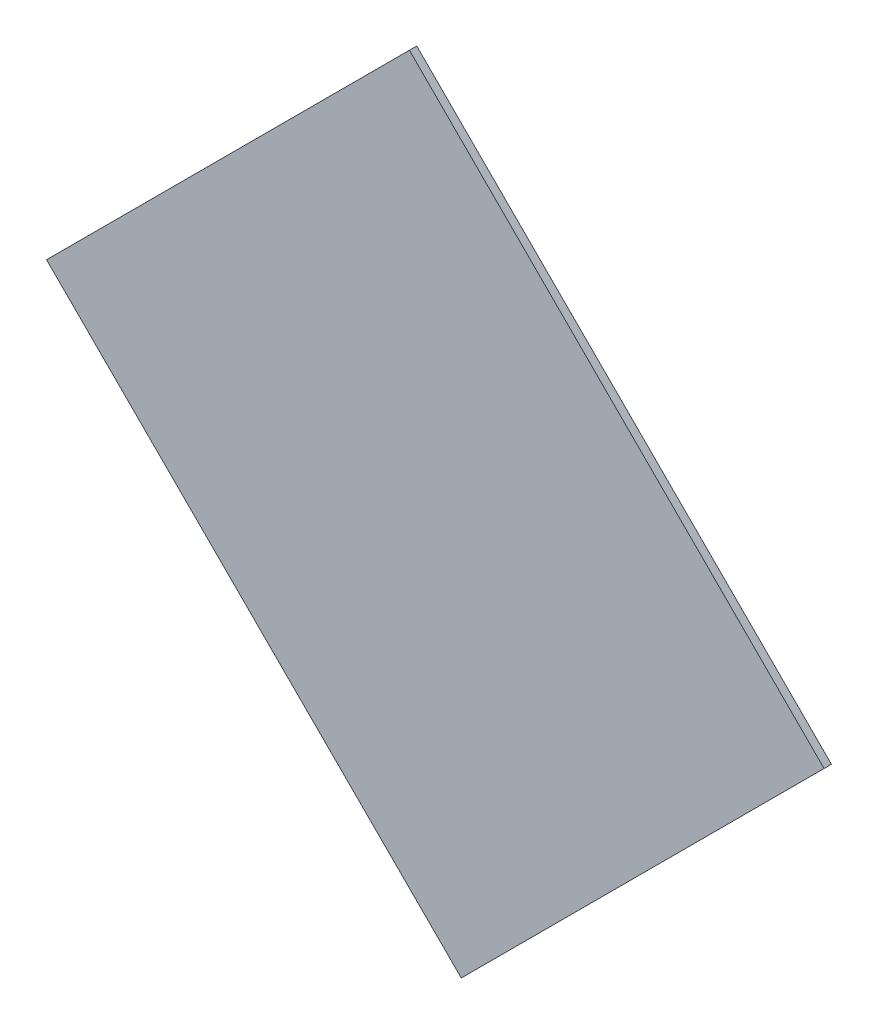
ISO-10303-21;
HEADER;
FILE_DESCRIPTION(('STEP AP214'),'2;1');
FILE_NAME('part.step','',(''),(''),'','','');
FILE_SCHEMA(('AUTOMOTIVE_DESIGN { 1 0 10303 214 1 1 1 1 }'));
ENDSEC;
DATA;
#1=APPLICATION_CONTEXT('core data for automotive mechanical design processes');
#2=APPLICATION_PROTOCOL_DEFINITION('international standard','automotive_design',2000,#1);
#3=PRODUCT_CONTEXT('',#1,'mechanical');
#4=PRODUCT('Part','Part','',(#3));
#5=PRODUCT_RELATED_PRODUCT_CATEGORY('part','',(#4));
#6=PRODUCT_DEFINITION_FORMATION('','',#4);
#7=PRODUCT_DEFINITION_CONTEXT('part definition',#1,'design');
#8=PRODUCT_DEFINITION('design','',#6,#7);
#9=PRODUCT_DEFINITION_SHAPE('','',#8);
#10=(LENGTH_UNIT() NAMED_UNIT(*) SI_UNIT(.MILLI.,.METRE.));
#11=(NAMED_UNIT(*) PLANE_ANGLE_UNIT() SI_UNIT($,.RADIAN.));
#12=(NAMED_UNIT(*) SI_UNIT($,.STERADIAN.) SOLID_ANGLE_UNIT());
#13=UNCERTAINTY_MEASURE_WITH_UNIT(LENGTH_MEASURE(1.E-05),#10,'distance_accuracy_value','');
#14=(GEOMETRIC_REPRESENTATION_CONTEXT(3) GLOBAL_UNCERTAINTY_ASSIGNED_CONTEXT((#13)) GLOBAL_UNIT_ASSIGNED_CONTEXT((#10,
#11,#12)) REPRESENTATION_CONTEXT('',''));
#15=CARTESIAN_POINT('',(0.,0.,0.));
#16=DIRECTION('',(0.,0.,1.));
#17=DIRECTION('',(1.,0.,0.));
#18=AXIS2_PLACEMENT_3D('',#15,#16,#17);
#19=CARTESIAN_POINT('',(9.9,7.92833,0.79916));
#20=DIRECTION('',(1.450297221417E-10,1.450297221417E-10,-1.));
#21=DIRECTION('',(-1.,0.,-1.450297221417E-10));
#22=AXIS2_PLACEMENT_3D('',#19,#20,#21);
#23=PLANE('',#22);
#24=DIRECTION('',(0.707106781186548,-0.707106781186548,0.));
#25=VECTOR('',#24,1.);
#26=CARTESIAN_POINT('',(10.2181980515334,9.23647754519545,0.799160000236));
#27=LINE('',#26,#25);
#28=CARTESIAN_POINT('',(9.65251262658486,9.80216297014411,0.799160000163967));
#29=VERTEX_POINT('',#28);
#30=CARTESIAN_POINT('',(10.2181980515336,9.2364775451946,0.799160000235967));
#31=VERTEX_POINT('',#30);
#32=EDGE_CURVE('E55',#29,#31,#27,.T.);
#33=ORIENTED_EDGE('',*,*,#32,.T.);
#34=DIRECTION('',(-0.707106781186548,-0.707106781186548,0.));
#35=VECTOR('',#34,1.);
#36=CARTESIAN_POINT('',(9.723223304702,8.741502798363,0.799160000236));
#37=LINE('',#36,#35);
#38=CARTESIAN_POINT('',(9.72322330470336,8.74150279836461,0.799160000164074));
#39=VERTEX_POINT('',#38);
#40=EDGE_CURVE('E76',#31,#39,#37,.T.);
#41=ORIENTED_EDGE('',*,*,#40,.T.);
#42=DIRECTION('',(-0.707106781186548,0.707106781186548,0.));
#43=VECTOR('',#42,1.);
#44=CARTESIAN_POINT('',(9.72322330470345,8.74150279836445,0.799160000092));
#45=LINE('',#44,#43);
#46=CARTESIAN_POINT('',(9.15753787975349,9.30718822331299,0.799160000092074));
#47=VERTEX_POINT('',#46);
#48=EDGE_CURVE('E58',#39,#47,#45,.T.);
#49=ORIENTED_EDGE('',*,*,#48,.T.);
#50=DIRECTION('',(0.707106781186548,0.707106781186548,0.));
#51=VECTOR('',#50,1.);
#52=CARTESIAN_POINT('',(9.157537879753,9.307188223312,0.799160000092));
#53=LINE('',#52,#51);
#54=EDGE_CURVE('E20',#47,#29,#53,.T.);
#55=ORIENTED_EDGE('',*,*,#54,.T.);
#56=EDGE_LOOP('',(#33,#41,#49,#55));
#57=FACE_BOUND('',#56,.T.);
#58=ADVANCED_FACE('F17',(#57),#23,.T.);
#59=CARTESIAN_POINT('',(9.157537879753,9.307188223312,0.809160000092));
#60=DIRECTION('',(0.707106781186548,-0.707106781186548,0.));
#61=DIRECTION('',(0.707106781186548,0.707106781186548,0.));
#62=AXIS2_PLACEMENT_3D('',#59,#60,#61);
#63=PLANE('',#62);
#64=DIRECTION('',(-1.45029722141612E-10,-1.45029722141612E-10,1.));
#65=VECTOR('',#64,1.);
#66=CARTESIAN_POINT('',(9.1575378797525,9.3071882233125,0.809160000092));
#67=LINE('',#66,#65);
#68=CARTESIAN_POINT('',(9.15753787975287,9.30718822331212,0.809160000164074));
#69=VERTEX_POINT('',#68);
#70=EDGE_CURVE('E78',#47,#69,#67,.T.);
#71=ORIENTED_EDGE('',*,*,#70,.T.);
#72=DIRECTION('',(0.707106781185832,0.707106781187262,2.05102861777807E-10));
#73=VECTOR('',#72,1.);
#74=CARTESIAN_POINT('',(9.157537879753,9.307188223312,0.809160000092296));
#75=LINE('',#74,#73);
#76=CARTESIAN_POINT('',(9.652512626584,9.8021629701435,0.809160000235967));
#77=VERTEX_POINT('',#76);
#78=EDGE_CURVE('E73',#69,#77,#75,.T.);
#79=ORIENTED_EDGE('',*,*,#78,.T.);
#80=DIRECTION('',(-1.45029722141612E-10,-1.45029722141612E-10,1.));
#81=VECTOR('',#80,1.);
#82=CARTESIAN_POINT('',(9.652512626583,9.802162970143,0.809160000236));
#83=LINE('',#82,#81);
#84=EDGE_CURVE('E63',#77,#29,#83,.F.);
#85=ORIENTED_EDGE('',*,*,#84,.T.);
#86=ORIENTED_EDGE('',*,*,#54,.F.);
#87=EDGE_LOOP('',(#71,#79,#85,#86));
#88=FACE_BOUND('',#87,.T.);
#89=ADVANCED_FACE('F72',(#88),#63,.F.);
#90=CARTESIAN_POINT('',(10.218198051532,9.236477545194,0.809160000236));
#91=DIRECTION('',(-0.707106781186548,-0.707106781186548,-2.05102999999869E-10));
#92=DIRECTION('',(0.707106781186548,-0.707106781186548,0.));
#93=AXIS2_PLACEMENT_3D('',#90,#91,#92);
#94=PLANE('',#93);
#95=ORIENTED_EDGE('',*,*,#84,.F.);
#96=DIRECTION('',(0.707106781186546,-0.707106781186549,0.));
#97=VECTOR('',#96,1.);
#98=CARTESIAN_POINT('',(9.652512626583,9.802162970143,0.809160000235868));
#99=LINE('',#98,#97);
#100=CARTESIAN_POINT('',(10.2181980515324,9.23647754519363,0.809160000199967));
#101=VERTEX_POINT('',#100);
#102=EDGE_CURVE('E83',#77,#101,#99,.T.);
#103=ORIENTED_EDGE('',*,*,#102,.T.);
#104=DIRECTION('',(0.,0.,1.));
#105=VECTOR('',#104,1.);
#106=CARTESIAN_POINT('',(10.2181980515325,9.2364775451935,0.809160000092));
#107=LINE('',#106,#105);
#108=EDGE_CURVE('E69',#101,#31,#107,.F.);
#109=ORIENTED_EDGE('',*,*,#108,.T.);
#110=ORIENTED_EDGE('',*,*,#32,.F.);
#111=EDGE_LOOP('',(#95,#103,#109,#110));
#112=FACE_BOUND('',#111,.T.);
#113=ADVANCED_FACE('F66',(#112),#94,.F.);
#114=CARTESIAN_POINT('',(9.723223304702,8.741502798363,0.809160000092));
#115=DIRECTION('',(-0.707106781186548,0.707106781186548,0.));
#116=DIRECTION('',(-0.707106781186548,-0.707106781186548,0.));
#117=AXIS2_PLACEMENT_3D('',#114,#115,#116);
#118=PLANE('',#117);
#119=ORIENTED_EDGE('',*,*,#108,.F.);
#120=DIRECTION('',(-0.707106781185831,-0.707106781187264,-2.05103171549856E-10));
#121=VECTOR('',#120,1.);
#122=CARTESIAN_POINT('',(10.218198051532,9.236477545194,0.809160000235868));
#123=LINE('',#122,#121);
#124=CARTESIAN_POINT('',(9.72322330470275,8.74150279836375,0.809160000092074));
#125=VERTEX_POINT('',#124);
#126=EDGE_CURVE('E26',#101,#125,#123,.T.);
#127=ORIENTED_EDGE('',*,*,#126,.T.);
#128=DIRECTION('',(-1.45029722141612E-10,-1.45029722141612E-10,1.));
#129=VECTOR('',#128,1.);
#130=CARTESIAN_POINT('',(9.723223304702,8.741502798363,0.809160000092));
#131=LINE('',#130,#129);
#132=EDGE_CURVE('E34',#125,#39,#131,.F.);
#133=ORIENTED_EDGE('',*,*,#132,.T.);
#134=ORIENTED_EDGE('',*,*,#40,.F.);
#135=EDGE_LOOP('',(#119,#127,#133,#134));
#136=FACE_BOUND('',#135,.T.);
#137=ADVANCED_FACE('F88',(#136),#118,.F.);
#138=CARTESIAN_POINT('',(9.723223304702,8.741502798363,0.809160000092));
#139=DIRECTION('',(0.707106781186548,0.707106781186548,2.05102999999869E-10));
#140=DIRECTION('',(-0.707106781186548,0.707106781186548,0.));
#141=AXIS2_PLACEMENT_3D('',#138,#139,#140);
#142=PLANE('',#141);
#143=ORIENTED_EDGE('',*,*,#132,.F.);
#144=DIRECTION('',(-0.707106781186545,0.70710678118655,0.));
#145=VECTOR('',#144,1.);
#146=CARTESIAN_POINT('',(9.723223304702,8.741502798363,0.809160000092296));
#147=LINE('',#146,#145);
#148=EDGE_CURVE('E11',#125,#69,#147,.T.);
#149=ORIENTED_EDGE('',*,*,#148,.T.);
#150=ORIENTED_EDGE('',*,*,#70,.F.);
#151=ORIENTED_EDGE('',*,*,#48,.F.);
#152=EDGE_LOOP('',(#143,#149,#150,#151));
#153=FACE_BOUND('',#152,.T.);
#154=ADVANCED_FACE('F91',(#153),#142,.F.);
#155=CARTESIAN_POINT('',(9.899999999999,7.928329999999,0.80916));
#156=DIRECTION('',(1.450297221417E-10,1.450297221417E-10,-1.));
#157=DIRECTION('',(-1.,0.,-1.450297221417E-10));
#158=AXIS2_PLACEMENT_3D('',#155,#156,#157);
#159=PLANE('',#158);
#160=ORIENTED_EDGE('',*,*,#126,.F.);
#161=ORIENTED_EDGE('',*,*,#102,.F.);
#162=ORIENTED_EDGE('',*,*,#78,.F.);
#163=ORIENTED_EDGE('',*,*,#148,.F.);
#164=EDGE_LOOP('',(#160,#161,#162,#163));
#165=FACE_BOUND('',#164,.T.);
#166=ADVANCED_FACE('F90',(#165),#159,.F.);
#167=CLOSED_SHELL('',(#58,#89,#113,#137,#154,#166));
#168=MANIFOLD_SOLID_BREP('B1',#167);
#169=ADVANCED_BREP_SHAPE_REPRESENTATION('',(#18,#168),#14);
#170=SHAPE_DEFINITION_REPRESENTATION(#9,#169);
ENDSEC;
END-ISO-10303-21;
